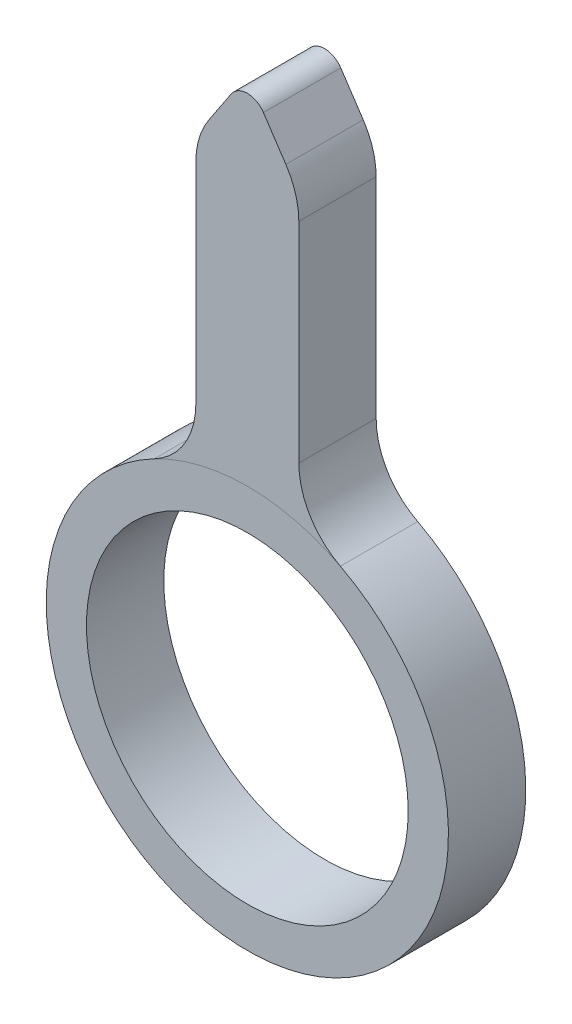
ISO-10303-21;
HEADER;
FILE_DESCRIPTION(('STEP AP214'),'2;1');
FILE_NAME('part.step','',(''),(''),'','','');
FILE_SCHEMA(('AUTOMOTIVE_DESIGN { 1 0 10303 214 1 1 1 1 }'));
ENDSEC;
DATA;
#1=APPLICATION_CONTEXT('core data for automotive mechanical design processes');
#2=APPLICATION_PROTOCOL_DEFINITION('international standard','automotive_design',2000,#1);
#3=PRODUCT_CONTEXT('',#1,'mechanical');
#4=PRODUCT('Part','Part','',(#3));
#5=PRODUCT_RELATED_PRODUCT_CATEGORY('part','',(#4));
#6=PRODUCT_DEFINITION_FORMATION('','',#4);
#7=PRODUCT_DEFINITION_CONTEXT('part definition',#1,'design');
#8=PRODUCT_DEFINITION('design','',#6,#7);
#9=PRODUCT_DEFINITION_SHAPE('','',#8);
#10=(LENGTH_UNIT() NAMED_UNIT(*) SI_UNIT(.MILLI.,.METRE.));
#11=(NAMED_UNIT(*) PLANE_ANGLE_UNIT() SI_UNIT($,.RADIAN.));
#12=(NAMED_UNIT(*) SI_UNIT($,.STERADIAN.) SOLID_ANGLE_UNIT());
#13=UNCERTAINTY_MEASURE_WITH_UNIT(LENGTH_MEASURE(1.E-05),#10,'distance_accuracy_value','');
#14=(GEOMETRIC_REPRESENTATION_CONTEXT(3) GLOBAL_UNCERTAINTY_ASSIGNED_CONTEXT((#13)) GLOBAL_UNIT_ASSIGNED_CONTEXT((#10,
#11,#12)) REPRESENTATION_CONTEXT('',''));
#15=CARTESIAN_POINT('',(0.,0.,0.));
#16=DIRECTION('',(0.,0.,1.));
#17=DIRECTION('',(1.,0.,0.));
#18=AXIS2_PLACEMENT_3D('',#15,#16,#17);
#19=CARTESIAN_POINT('',(0.,0.,1.5875));
#20=DIRECTION('',(0.,0.,1.));
#21=DIRECTION('',(1.,0.,0.));
#22=AXIS2_PLACEMENT_3D('',#19,#20,#21);
#23=PLANE('',#22);
#24=CARTESIAN_POINT('',(0.,0.,1.5875));
#25=DIRECTION('',(0.,0.,1.));
#26=DIRECTION('',(1.,0.,0.));
#27=AXIS2_PLACEMENT_3D('',#24,#25,#26);
#28=CIRCLE('',#27,3.302);
#29=CARTESIAN_POINT('',(3.302,0.,1.5875));
#30=VERTEX_POINT('',#29);
#31=EDGE_CURVE('E135',#30,#30,#28,.T.);
#32=ORIENTED_EDGE('',*,*,#31,.F.);
#33=EDGE_LOOP('',(#32));
#34=FACE_BOUND('',#33,.T.);
#35=CARTESIAN_POINT('',(0.,0.,1.5875));
#36=DIRECTION('',(0.,0.,1.));
#37=DIRECTION('',(1.,0.,0.));
#38=AXIS2_PLACEMENT_3D('',#35,#36,#37);
#39=CIRCLE('',#38,4.1275);
#40=CARTESIAN_POINT('',(1.90965429025841,3.65916339368682,1.5875));
#41=VERTEX_POINT('',#40);
#42=CARTESIAN_POINT('',(-1.90965666666667,3.65916215347934,1.5875));
#43=VERTEX_POINT('',#42);
#44=EDGE_CURVE('E51',#41,#43,#39,.T.);
#45=ORIENTED_EDGE('',*,*,#44,.T.);
#46=CARTESIAN_POINT('',(0.,0.,1.5875));
#47=DIRECTION('',(0.,0.,1.));
#48=DIRECTION('',(1.,0.,0.));
#49=AXIS2_PLACEMENT_3D('',#46,#47,#48);
#50=CIRCLE('',#49,4.1275);
#51=EDGE_CURVE('E204',#43,#41,#50,.T.);
#52=ORIENTED_EDGE('',*,*,#51,.T.);
#53=EDGE_LOOP('',(#45,#52));
#54=FACE_BOUND('',#53,.T.);
#55=ADVANCED_FACE('F36',(#34,#54),#23,.T.);
#56=DIRECTION('',(-0.554085305216421,0.832459893654479,0.));
#57=VECTOR('',#56,1.);
#58=CARTESIAN_POINT('',(0.,11.43,1.5875));
#59=LINE('',#58,#57);
#60=CARTESIAN_POINT('',(0.790670081176485,10.2420942290017,1.5875));
#61=VERTEX_POINT('',#60);
#62=CARTESIAN_POINT('',(0.330382520294121,10.9336320308081,1.5875));
#63=VERTEX_POINT('',#62);
#64=EDGE_CURVE('E128',#61,#63,#59,.T.);
#65=ORIENTED_EDGE('',*,*,#64,.T.);
#66=CARTESIAN_POINT('',(0.,10.7137294253003,1.5875));
#67=DIRECTION('',(0.,0.,1.));
#68=DIRECTION('',(1.,0.,0.));
#69=AXIS2_PLACEMENT_3D('',#66,#67,#68);
#70=CIRCLE('',#69,0.396875);
#71=CARTESIAN_POINT('',(-0.330382520294121,10.9336320308081,1.5875));
#72=VERTEX_POINT('',#71);
#73=EDGE_CURVE('E174',#63,#72,#70,.T.);
#74=ORIENTED_EDGE('',*,*,#73,.T.);
#75=DIRECTION('',(-0.554085305216421,-0.832459893654479,0.));
#76=VECTOR('',#75,1.);
#77=CARTESIAN_POINT('',(0.,11.43,1.5875));
#78=LINE('',#77,#76);
#79=CARTESIAN_POINT('',(-0.790670081176485,10.2420942290017,1.5875));
#80=VERTEX_POINT('',#79);
#81=EDGE_CURVE('E207',#72,#80,#78,.T.);
#82=ORIENTED_EDGE('',*,*,#81,.T.);
#83=CARTESIAN_POINT('',(0.53086,9.36248380697061,1.5875));
#84=DIRECTION('',(0.,0.,1.));
#85=DIRECTION('',(1.,0.,0.));
#86=AXIS2_PLACEMENT_3D('',#83,#84,#85);
#87=CIRCLE('',#86,1.5875);
#88=CARTESIAN_POINT('',(-1.05664,9.36248380697061,1.5875));
#89=VERTEX_POINT('',#88);
#90=EDGE_CURVE('E158',#80,#89,#87,.T.);
#91=ORIENTED_EDGE('',*,*,#90,.T.);
#92=DIRECTION('',(0.,-1.,0.));
#93=VECTOR('',#92,1.);
#94=CARTESIAN_POINT('',(-1.05664,3.98995841587353,1.5875));
#95=LINE('',#94,#93);
#96=CARTESIAN_POINT('',(-1.05664,5.06653221250985,1.5875));
#97=VERTEX_POINT('',#96);
#98=EDGE_CURVE('E205',#89,#97,#95,.T.);
#99=ORIENTED_EDGE('',*,*,#98,.T.);
#100=CARTESIAN_POINT('',(-2.64414,5.06653221250985,1.5875));
#101=DIRECTION('',(0.,0.,1.));
#102=DIRECTION('',(1.,0.,0.));
#103=AXIS2_PLACEMENT_3D('',#100,#101,#102);
#104=CIRCLE('',#103,1.5875);
#105=EDGE_CURVE('E189',#97,#43,#104,.F.);
#106=ORIENTED_EDGE('',*,*,#105,.T.);
#107=ORIENTED_EDGE('',*,*,#44,.F.);
#108=CARTESIAN_POINT('',(2.64414,5.06653221250985,1.5875));
#109=DIRECTION('',(0.,0.,1.));
#110=DIRECTION('',(1.,0.,0.));
#111=AXIS2_PLACEMENT_3D('',#108,#109,#110);
#112=CIRCLE('',#111,1.5875);
#113=CARTESIAN_POINT('',(1.05664,5.06653221250985,1.5875));
#114=VERTEX_POINT('',#113);
#115=EDGE_CURVE('E11',#41,#114,#112,.F.);
#116=ORIENTED_EDGE('',*,*,#115,.T.);
#117=DIRECTION('',(0.,1.,0.));
#118=VECTOR('',#117,1.);
#119=CARTESIAN_POINT('',(1.05664,3.98995841587353,1.5875));
#120=LINE('',#119,#118);
#121=CARTESIAN_POINT('',(1.05664,9.36248380697061,1.5875));
#122=VERTEX_POINT('',#121);
#123=EDGE_CURVE('E143',#114,#122,#120,.T.);
#124=ORIENTED_EDGE('',*,*,#123,.T.);
#125=CARTESIAN_POINT('',(-0.53086,9.36248380697061,1.5875));
#126=DIRECTION('',(0.,0.,1.));
#127=DIRECTION('',(1.,0.,0.));
#128=AXIS2_PLACEMENT_3D('',#125,#126,#127);
#129=CIRCLE('',#128,1.5875);
#130=EDGE_CURVE('E160',#122,#61,#129,.T.);
#131=ORIENTED_EDGE('',*,*,#130,.T.);
#132=EDGE_LOOP('',(#65,#74,#82,#91,#99,#106,#107,#116,#124,#131));
#133=FACE_BOUND('',#132,.T.);
#134=ADVANCED_FACE('F201',(#133),#23,.T.);
#135=CARTESIAN_POINT('',(0.,0.,0.));
#136=DIRECTION('',(0.,0.,1.));
#137=DIRECTION('',(1.,0.,0.));
#138=AXIS2_PLACEMENT_3D('',#135,#136,#137);
#139=PLANE('',#138);
#140=DIRECTION('',(-0.554085305216421,-0.832459893654479,0.));
#141=VECTOR('',#140,1.);
#142=CARTESIAN_POINT('',(0.,11.43,0.));
#143=LINE('',#142,#141);
#144=CARTESIAN_POINT('',(-0.330382520294121,10.9336320308081,0.));
#145=VERTEX_POINT('',#144);
#146=CARTESIAN_POINT('',(-0.790670081176485,10.2420942290017,0.));
#147=VERTEX_POINT('',#146);
#148=EDGE_CURVE('E134',#145,#147,#143,.T.);
#149=ORIENTED_EDGE('',*,*,#148,.F.);
#150=CARTESIAN_POINT('',(0.,10.7137294253003,0.));
#151=DIRECTION('',(0.,0.,1.));
#152=DIRECTION('',(1.,0.,0.));
#153=AXIS2_PLACEMENT_3D('',#150,#151,#152);
#154=CIRCLE('',#153,0.396875);
#155=CARTESIAN_POINT('',(0.330382520294121,10.9336320308081,0.));
#156=VERTEX_POINT('',#155);
#157=EDGE_CURVE('E133',#145,#156,#154,.F.);
#158=ORIENTED_EDGE('',*,*,#157,.T.);
#159=DIRECTION('',(-0.554085305216421,0.832459893654479,0.));
#160=VECTOR('',#159,1.);
#161=CARTESIAN_POINT('',(0.,11.43,0.));
#162=LINE('',#161,#160);
#163=CARTESIAN_POINT('',(0.790670081176485,10.2420942290017,0.));
#164=VERTEX_POINT('',#163);
#165=EDGE_CURVE('E125',#164,#156,#162,.T.);
#166=ORIENTED_EDGE('',*,*,#165,.F.);
#167=CARTESIAN_POINT('',(-0.53086,9.36248380697061,0.));
#168=DIRECTION('',(0.,0.,1.));
#169=DIRECTION('',(1.,0.,0.));
#170=AXIS2_PLACEMENT_3D('',#167,#168,#169);
#171=CIRCLE('',#170,1.5875);
#172=CARTESIAN_POINT('',(1.05664,9.36248380697061,0.));
#173=VERTEX_POINT('',#172);
#174=EDGE_CURVE('E109',#164,#173,#171,.F.);
#175=ORIENTED_EDGE('',*,*,#174,.T.);
#176=DIRECTION('',(0.,1.,0.));
#177=VECTOR('',#176,1.);
#178=CARTESIAN_POINT('',(1.05664,3.98995841587353,0.));
#179=LINE('',#178,#177);
#180=CARTESIAN_POINT('',(1.05664,5.06653221250985,0.));
#181=VERTEX_POINT('',#180);
#182=EDGE_CURVE('E151',#181,#173,#179,.T.);
#183=ORIENTED_EDGE('',*,*,#182,.F.);
#184=CARTESIAN_POINT('',(2.64414,5.06653221250985,0.));
#185=DIRECTION('',(0.,0.,1.));
#186=DIRECTION('',(1.,0.,0.));
#187=AXIS2_PLACEMENT_3D('',#184,#185,#186);
#188=CIRCLE('',#187,1.5875);
#189=CARTESIAN_POINT('',(1.90965666666667,3.65916215347934,0.));
#190=VERTEX_POINT('',#189);
#191=EDGE_CURVE('E45',#181,#190,#188,.T.);
#192=ORIENTED_EDGE('',*,*,#191,.T.);
#193=CARTESIAN_POINT('',(0.,0.,0.));
#194=DIRECTION('',(0.,0.,1.));
#195=DIRECTION('',(1.,0.,0.));
#196=AXIS2_PLACEMENT_3D('',#193,#194,#195);
#197=CIRCLE('',#196,4.1275);
#198=CARTESIAN_POINT('',(-1.90965666666667,3.65916215347934,0.));
#199=VERTEX_POINT('',#198);
#200=EDGE_CURVE('E148',#199,#190,#197,.T.);
#201=ORIENTED_EDGE('',*,*,#200,.F.);
#202=CARTESIAN_POINT('',(-2.64414,5.06653221250985,0.));
#203=DIRECTION('',(0.,0.,1.));
#204=DIRECTION('',(1.,0.,0.));
#205=AXIS2_PLACEMENT_3D('',#202,#203,#204);
#206=CIRCLE('',#205,1.5875);
#207=CARTESIAN_POINT('',(-1.05664,5.06653221250985,0.));
#208=VERTEX_POINT('',#207);
#209=EDGE_CURVE('E187',#199,#208,#206,.T.);
#210=ORIENTED_EDGE('',*,*,#209,.T.);
#211=DIRECTION('',(0.,-1.,0.));
#212=VECTOR('',#211,1.);
#213=CARTESIAN_POINT('',(-1.05664,3.98995841587353,0.));
#214=LINE('',#213,#212);
#215=CARTESIAN_POINT('',(-1.05664,9.36248380697061,0.));
#216=VERTEX_POINT('',#215);
#217=EDGE_CURVE('E137',#216,#208,#214,.T.);
#218=ORIENTED_EDGE('',*,*,#217,.F.);
#219=CARTESIAN_POINT('',(0.53086,9.36248380697061,0.));
#220=DIRECTION('',(0.,0.,1.));
#221=DIRECTION('',(1.,0.,0.));
#222=AXIS2_PLACEMENT_3D('',#219,#220,#221);
#223=CIRCLE('',#222,1.5875);
#224=EDGE_CURVE('E119',#216,#147,#223,.F.);
#225=ORIENTED_EDGE('',*,*,#224,.T.);
#226=EDGE_LOOP('',(#149,#158,#166,#175,#183,#192,#201,#210,#218,#225));
#227=FACE_BOUND('',#226,.T.);
#228=CARTESIAN_POINT('',(0.,0.,0.));
#229=DIRECTION('',(0.,0.,1.));
#230=DIRECTION('',(1.,0.,0.));
#231=AXIS2_PLACEMENT_3D('',#228,#229,#230);
#232=CIRCLE('',#231,3.302);
#233=CARTESIAN_POINT('',(3.302,0.,0.));
#234=VERTEX_POINT('',#233);
#235=EDGE_CURVE('E140',#234,#234,#232,.T.);
#236=ORIENTED_EDGE('',*,*,#235,.T.);
#237=EDGE_LOOP('',(#236));
#238=FACE_BOUND('',#237,.T.);
#239=ADVANCED_FACE('F131',(#227,#238),#139,.F.);
#240=CARTESIAN_POINT('',(0.,11.43,1.5875));
#241=DIRECTION('',(-0.832459893654478,-0.554085305216421,0.));
#242=DIRECTION('',(0.554085305216421,-0.832459893654479,0.));
#243=AXIS2_PLACEMENT_3D('',#240,#241,#242);
#244=PLANE('',#243);
#245=ORIENTED_EDGE('',*,*,#165,.T.);
#246=DIRECTION('',(0.,0.,-1.));
#247=VECTOR('',#246,1.);
#248=CARTESIAN_POINT('',(0.330382520294121,10.9336320308081,1.5875));
#249=LINE('',#248,#247);
#250=EDGE_CURVE('E172',#156,#63,#249,.F.);
#251=ORIENTED_EDGE('',*,*,#250,.T.);
#252=ORIENTED_EDGE('',*,*,#64,.F.);
#253=DIRECTION('',(0.,0.,-1.));
#254=VECTOR('',#253,1.);
#255=CARTESIAN_POINT('',(0.790670081176485,10.2420942290017,1.5875));
#256=LINE('',#255,#254);
#257=EDGE_CURVE('E113',#61,#164,#256,.T.);
#258=ORIENTED_EDGE('',*,*,#257,.T.);
#259=EDGE_LOOP('',(#245,#251,#252,#258));
#260=FACE_BOUND('',#259,.T.);
#261=ADVANCED_FACE('F124',(#260),#244,.F.);
#262=CARTESIAN_POINT('',(0.,11.43,1.5875));
#263=DIRECTION('',(0.832459893654478,-0.554085305216421,0.));
#264=DIRECTION('',(0.554085305216421,0.832459893654479,0.));
#265=AXIS2_PLACEMENT_3D('',#262,#263,#264);
#266=PLANE('',#265);
#267=ORIENTED_EDGE('',*,*,#81,.F.);
#268=DIRECTION('',(0.,0.,-1.));
#269=VECTOR('',#268,1.);
#270=CARTESIAN_POINT('',(-0.330382520294121,10.9336320308081,1.5875));
#271=LINE('',#270,#269);
#272=EDGE_CURVE('E168',#72,#145,#271,.T.);
#273=ORIENTED_EDGE('',*,*,#272,.T.);
#274=ORIENTED_EDGE('',*,*,#148,.T.);
#275=DIRECTION('',(0.,0.,-1.));
#276=VECTOR('',#275,1.);
#277=CARTESIAN_POINT('',(-0.790670081176485,10.2420942290017,1.5875));
#278=LINE('',#277,#276);
#279=EDGE_CURVE('E165',#147,#80,#278,.F.);
#280=ORIENTED_EDGE('',*,*,#279,.T.);
#281=EDGE_LOOP('',(#267,#273,#274,#280));
#282=FACE_BOUND('',#281,.T.);
#283=ADVANCED_FACE('F241',(#282),#266,.F.);
#284=CARTESIAN_POINT('',(-1.05664,3.98995841587353,1.5875));
#285=DIRECTION('',(1.,0.,0.));
#286=DIRECTION('',(0.,0.,-1.));
#287=AXIS2_PLACEMENT_3D('',#284,#285,#286);
#288=PLANE('',#287);
#289=ORIENTED_EDGE('',*,*,#217,.T.);
#290=DIRECTION('',(0.,0.,1.));
#291=VECTOR('',#290,1.);
#292=CARTESIAN_POINT('',(-1.05664,5.06653221250985,1.5875));
#293=LINE('',#292,#291);
#294=EDGE_CURVE('E182',#208,#97,#293,.T.);
#295=ORIENTED_EDGE('',*,*,#294,.T.);
#296=ORIENTED_EDGE('',*,*,#98,.F.);
#297=DIRECTION('',(0.,0.,-1.));
#298=VECTOR('',#297,1.);
#299=CARTESIAN_POINT('',(-1.05664,9.36248380697061,1.5875));
#300=LINE('',#299,#298);
#301=EDGE_CURVE('E162',#89,#216,#300,.T.);
#302=ORIENTED_EDGE('',*,*,#301,.T.);
#303=EDGE_LOOP('',(#289,#295,#296,#302));
#304=FACE_BOUND('',#303,.T.);
#305=ADVANCED_FACE('F238',(#304),#288,.F.);
#306=CARTESIAN_POINT('',(0.,0.,1.5875));
#307=DIRECTION('',(0.,0.,-1.));
#308=DIRECTION('',(-1.,0.,0.));
#309=AXIS2_PLACEMENT_3D('',#306,#307,#308);
#310=CYLINDRICAL_SURFACE('',#309,4.1275);
#311=ORIENTED_EDGE('',*,*,#51,.F.);
#312=DIRECTION('',(0.,0.,-1.));
#313=VECTOR('',#312,1.);
#314=CARTESIAN_POINT('',(-1.90965666666667,3.65916215347934,1.5875));
#315=LINE('',#314,#313);
#316=EDGE_CURVE('E179',#43,#199,#315,.T.);
#317=ORIENTED_EDGE('',*,*,#316,.T.);
#318=ORIENTED_EDGE('',*,*,#200,.T.);
#319=DIRECTION('',(0.,0.,-1.));
#320=VECTOR('',#319,1.);
#321=CARTESIAN_POINT('',(1.90965666666667,3.65916215347934,1.5875));
#322=LINE('',#321,#320);
#323=EDGE_CURVE('E176',#190,#41,#322,.F.);
#324=ORIENTED_EDGE('',*,*,#323,.T.);
#325=EDGE_LOOP('',(#311,#317,#318,#324));
#326=FACE_BOUND('',#325,.T.);
#327=ADVANCED_FACE('F196',(#326),#310,.T.);
#328=CARTESIAN_POINT('',(1.05664,3.98995841587353,1.5875));
#329=DIRECTION('',(-1.,0.,0.));
#330=DIRECTION('',(0.,0.,1.));
#331=AXIS2_PLACEMENT_3D('',#328,#329,#330);
#332=PLANE('',#331);
#333=ORIENTED_EDGE('',*,*,#123,.F.);
#334=DIRECTION('',(0.,0.,1.));
#335=VECTOR('',#334,1.);
#336=CARTESIAN_POINT('',(1.05664,5.06653221250985,0.));
#337=LINE('',#336,#335);
#338=EDGE_CURVE('E184',#114,#181,#337,.F.);
#339=ORIENTED_EDGE('',*,*,#338,.T.);
#340=ORIENTED_EDGE('',*,*,#182,.T.);
#341=DIRECTION('',(0.,0.,-1.));
#342=VECTOR('',#341,1.);
#343=CARTESIAN_POINT('',(1.05664,9.36248380697061,1.5875));
#344=LINE('',#343,#342);
#345=EDGE_CURVE('E115',#173,#122,#344,.F.);
#346=ORIENTED_EDGE('',*,*,#345,.T.);
#347=EDGE_LOOP('',(#333,#339,#340,#346));
#348=FACE_BOUND('',#347,.T.);
#349=ADVANCED_FACE('F203',(#348),#332,.F.);
#350=CARTESIAN_POINT('',(0.,0.,1.5875));
#351=DIRECTION('',(0.,0.,-1.));
#352=DIRECTION('',(-1.,0.,0.));
#353=AXIS2_PLACEMENT_3D('',#350,#351,#352);
#354=CYLINDRICAL_SURFACE('',#353,3.302);
#355=ORIENTED_EDGE('',*,*,#31,.T.);
#356=EDGE_LOOP('',(#355));
#357=FACE_BOUND('',#356,.T.);
#358=ORIENTED_EDGE('',*,*,#235,.F.);
#359=EDGE_LOOP('',(#358));
#360=FACE_BOUND('',#359,.T.);
#361=ADVANCED_FACE('F215',(#357,#360),#354,.F.);
#362=CARTESIAN_POINT('',(-0.53086,9.36248380697061,1.5875));
#363=DIRECTION('',(0.,0.,-1.));
#364=DIRECTION('',(-1.,0.,0.));
#365=AXIS2_PLACEMENT_3D('',#362,#363,#364);
#366=CYLINDRICAL_SURFACE('',#365,1.5875);
#367=ORIENTED_EDGE('',*,*,#130,.F.);
#368=ORIENTED_EDGE('',*,*,#345,.F.);
#369=ORIENTED_EDGE('',*,*,#174,.F.);
#370=ORIENTED_EDGE('',*,*,#257,.F.);
#371=EDGE_LOOP('',(#367,#368,#369,#370));
#372=FACE_BOUND('',#371,.T.);
#373=ADVANCED_FACE('F112',(#372),#366,.T.);
#374=CARTESIAN_POINT('',(0.53086,9.36248380697061,1.5875));
#375=DIRECTION('',(0.,0.,-1.));
#376=DIRECTION('',(-1.,0.,0.));
#377=AXIS2_PLACEMENT_3D('',#374,#375,#376);
#378=CYLINDRICAL_SURFACE('',#377,1.5875);
#379=ORIENTED_EDGE('',*,*,#90,.F.);
#380=ORIENTED_EDGE('',*,*,#279,.F.);
#381=ORIENTED_EDGE('',*,*,#224,.F.);
#382=ORIENTED_EDGE('',*,*,#301,.F.);
#383=EDGE_LOOP('',(#379,#380,#381,#382));
#384=FACE_BOUND('',#383,.T.);
#385=ADVANCED_FACE('F223',(#384),#378,.T.);
#386=CARTESIAN_POINT('',(0.,10.7137294253003,1.5875));
#387=DIRECTION('',(0.,0.,-1.));
#388=DIRECTION('',(-1.,0.,0.));
#389=AXIS2_PLACEMENT_3D('',#386,#387,#388);
#390=CYLINDRICAL_SURFACE('',#389,0.396875);
#391=ORIENTED_EDGE('',*,*,#73,.F.);
#392=ORIENTED_EDGE('',*,*,#250,.F.);
#393=ORIENTED_EDGE('',*,*,#157,.F.);
#394=ORIENTED_EDGE('',*,*,#272,.F.);
#395=EDGE_LOOP('',(#391,#392,#393,#394));
#396=FACE_BOUND('',#395,.T.);
#397=ADVANCED_FACE('F250',(#396),#390,.T.);
#398=CARTESIAN_POINT('',(-2.64414,5.06653221250985,1.5875));
#399=DIRECTION('',(0.,0.,-1.));
#400=DIRECTION('',(-1.,0.,0.));
#401=AXIS2_PLACEMENT_3D('',#398,#399,#400);
#402=CYLINDRICAL_SURFACE('',#401,1.5875);
#403=ORIENTED_EDGE('',*,*,#105,.F.);
#404=ORIENTED_EDGE('',*,*,#294,.F.);
#405=ORIENTED_EDGE('',*,*,#209,.F.);
#406=ORIENTED_EDGE('',*,*,#316,.F.);
#407=EDGE_LOOP('',(#403,#404,#405,#406));
#408=FACE_BOUND('',#407,.T.);
#409=ADVANCED_FACE('F253',(#408),#402,.F.);
#410=CARTESIAN_POINT('',(2.64414,5.06653221250985,1.5875));
#411=DIRECTION('',(0.,0.,-1.));
#412=DIRECTION('',(-1.,0.,0.));
#413=AXIS2_PLACEMENT_3D('',#410,#411,#412);
#414=CYLINDRICAL_SURFACE('',#413,1.5875);
#415=ORIENTED_EDGE('',*,*,#115,.F.);
#416=ORIENTED_EDGE('',*,*,#323,.F.);
#417=ORIENTED_EDGE('',*,*,#191,.F.);
#418=ORIENTED_EDGE('',*,*,#338,.F.);
#419=EDGE_LOOP('',(#415,#416,#417,#418));
#420=FACE_BOUND('',#419,.T.);
#421=ADVANCED_FACE('F38',(#420),#414,.F.);
#422=CLOSED_SHELL('',(#55,#134,#239,#261,#283,#305,#327,#349,#361,#373,#385,#397,#409,#421));
#423=MANIFOLD_SOLID_BREP('B2',#422);
#424=ADVANCED_BREP_SHAPE_REPRESENTATION('',(#18,#423),#14);
#425=SHAPE_DEFINITION_REPRESENTATION(#9,#424);
ENDSEC;
END-ISO-10303-21;
